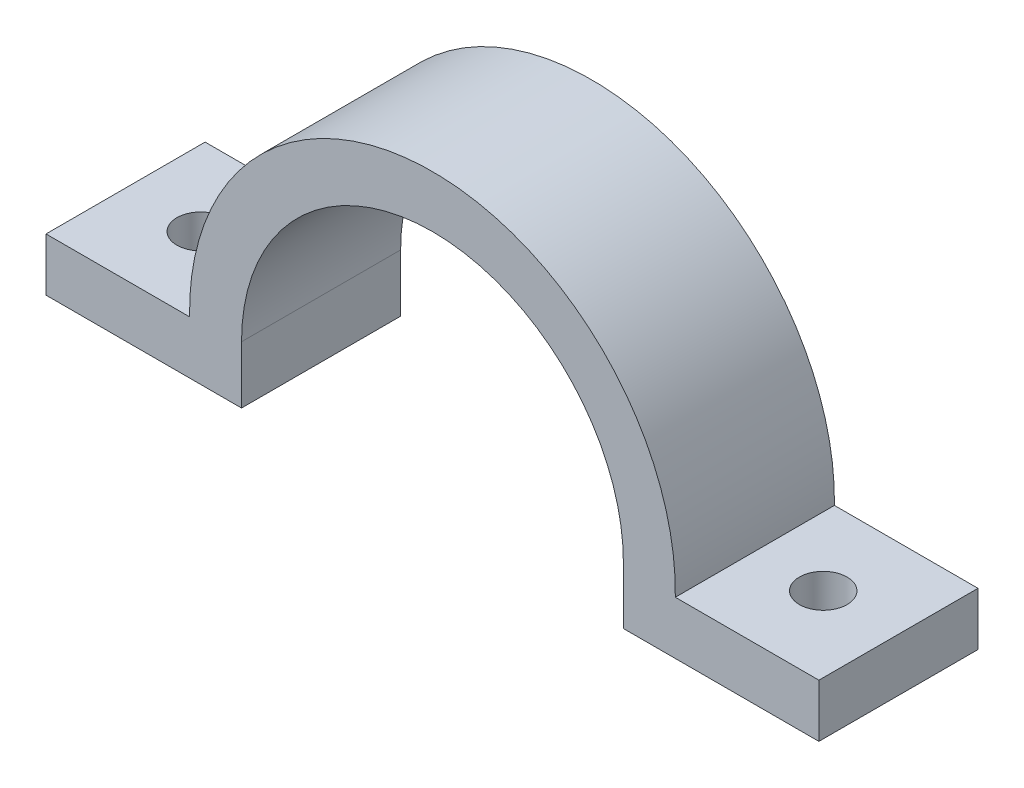
ISO-10303-21;
HEADER;
FILE_DESCRIPTION(('STEP AP214'),'2;1');
FILE_NAME('part.step','',(''),(''),'','','');
FILE_SCHEMA(('AUTOMOTIVE_DESIGN { 1 0 10303 214 1 1 1 1 }'));
ENDSEC;
DATA;
#1=APPLICATION_CONTEXT('core data for automotive mechanical design processes');
#2=APPLICATION_PROTOCOL_DEFINITION('international standard','automotive_design',2000,#1);
#3=PRODUCT_CONTEXT('',#1,'mechanical');
#4=PRODUCT('Part','Part','',(#3));
#5=PRODUCT_RELATED_PRODUCT_CATEGORY('part','',(#4));
#6=PRODUCT_DEFINITION_FORMATION('','',#4);
#7=PRODUCT_DEFINITION_CONTEXT('part definition',#1,'design');
#8=PRODUCT_DEFINITION('design','',#6,#7);
#9=PRODUCT_DEFINITION_SHAPE('','',#8);
#10=(LENGTH_UNIT() NAMED_UNIT(*) SI_UNIT(.MILLI.,.METRE.));
#11=(NAMED_UNIT(*) PLANE_ANGLE_UNIT() SI_UNIT($,.RADIAN.));
#12=(NAMED_UNIT(*) SI_UNIT($,.STERADIAN.) SOLID_ANGLE_UNIT());
#13=UNCERTAINTY_MEASURE_WITH_UNIT(LENGTH_MEASURE(1.E-05),#10,'distance_accuracy_value','');
#14=(GEOMETRIC_REPRESENTATION_CONTEXT(3) GLOBAL_UNCERTAINTY_ASSIGNED_CONTEXT((#13)) GLOBAL_UNIT_ASSIGNED_CONTEXT((#10,
#11,#12)) REPRESENTATION_CONTEXT('',''));
#15=CARTESIAN_POINT('',(0.,0.,0.));
#16=DIRECTION('',(0.,0.,1.));
#17=DIRECTION('',(1.,0.,0.));
#18=AXIS2_PLACEMENT_3D('',#15,#16,#17);
#19=CARTESIAN_POINT('',(0.,-5.4125,15.));
#20=DIRECTION('',(0.,1.,0.));
#21=DIRECTION('',(0.,0.,1.));
#22=AXIS2_PLACEMENT_3D('',#19,#20,#21);
#23=PLANE('',#22);
#24=CARTESIAN_POINT('',(-29.3423,-5.4125,7.5));
#25=DIRECTION('',(0.,1.,0.));
#26=DIRECTION('',(-1.,0.,0.));
#27=AXIS2_PLACEMENT_3D('',#24,#25,#26);
#28=CIRCLE('',#27,2.25);
#29=CARTESIAN_POINT('',(-31.5923,-5.4125,7.5));
#30=VERTEX_POINT('',#29);
#31=EDGE_CURVE('E191',#30,#30,#28,.T.);
#32=ORIENTED_EDGE('',*,*,#31,.T.);
#33=EDGE_LOOP('',(#32));
#34=FACE_BOUND('',#33,.T.);
#35=DIRECTION('',(1.,0.,0.));
#36=VECTOR('',#35,1.);
#37=CARTESIAN_POINT('',(0.,-5.4125,0.));
#38=LINE('',#37,#36);
#39=CARTESIAN_POINT('',(-36.4334,-5.4125,0.));
#40=VERTEX_POINT('',#39);
#41=CARTESIAN_POINT('',(-18.,-5.4125,0.));
#42=VERTEX_POINT('',#41);
#43=EDGE_CURVE('E152',#40,#42,#38,.T.);
#44=ORIENTED_EDGE('',*,*,#43,.T.);
#45=DIRECTION('',(0.,0.,-1.));
#46=VECTOR('',#45,1.);
#47=CARTESIAN_POINT('',(-18.,-5.4125,15.));
#48=LINE('',#47,#46);
#49=CARTESIAN_POINT('',(-18.,-5.4125,15.));
#50=VERTEX_POINT('',#49);
#51=EDGE_CURVE('E11',#50,#42,#48,.T.);
#52=ORIENTED_EDGE('',*,*,#51,.F.);
#53=DIRECTION('',(1.,0.,0.));
#54=VECTOR('',#53,1.);
#55=CARTESIAN_POINT('',(0.,-5.4125,15.));
#56=LINE('',#55,#54);
#57=CARTESIAN_POINT('',(-36.4334,-5.4125,15.));
#58=VERTEX_POINT('',#57);
#59=EDGE_CURVE('E175',#58,#50,#56,.T.);
#60=ORIENTED_EDGE('',*,*,#59,.F.);
#61=DIRECTION('',(0.,0.,-1.));
#62=VECTOR('',#61,1.);
#63=CARTESIAN_POINT('',(-36.4334,-5.4125,15.));
#64=LINE('',#63,#62);
#65=EDGE_CURVE('E59',#58,#40,#64,.T.);
#66=ORIENTED_EDGE('',*,*,#65,.T.);
#67=EDGE_LOOP('',(#44,#52,#60,#66));
#68=FACE_BOUND('',#67,.T.);
#69=ADVANCED_FACE('F41',(#34,#68),#23,.F.);
#70=CARTESIAN_POINT('',(-18.,0.,15.));
#71=DIRECTION('',(-1.,0.,0.));
#72=DIRECTION('',(0.,0.,1.));
#73=AXIS2_PLACEMENT_3D('',#70,#71,#72);
#74=PLANE('',#73);
#75=DIRECTION('',(0.,1.,0.));
#76=VECTOR('',#75,1.);
#77=CARTESIAN_POINT('',(-18.,0.,0.));
#78=LINE('',#77,#76);
#79=CARTESIAN_POINT('',(-18.,0.,0.));
#80=VERTEX_POINT('',#79);
#81=EDGE_CURVE('E154',#42,#80,#78,.T.);
#82=ORIENTED_EDGE('',*,*,#81,.T.);
#83=DIRECTION('',(0.,0.,-1.));
#84=VECTOR('',#83,1.);
#85=CARTESIAN_POINT('',(-18.,0.,15.));
#86=LINE('',#85,#84);
#87=CARTESIAN_POINT('',(-18.,0.,15.));
#88=VERTEX_POINT('',#87);
#89=EDGE_CURVE('E50',#88,#80,#86,.T.);
#90=ORIENTED_EDGE('',*,*,#89,.F.);
#91=DIRECTION('',(0.,1.,0.));
#92=VECTOR('',#91,1.);
#93=CARTESIAN_POINT('',(-18.,0.,15.));
#94=LINE('',#93,#92);
#95=EDGE_CURVE('E103',#50,#88,#94,.T.);
#96=ORIENTED_EDGE('',*,*,#95,.F.);
#97=ORIENTED_EDGE('',*,*,#51,.T.);
#98=EDGE_LOOP('',(#82,#90,#96,#97));
#99=FACE_BOUND('',#98,.T.);
#100=ADVANCED_FACE('F240',(#99),#74,.F.);
#101=CARTESIAN_POINT('',(0.,0.,15.));
#102=DIRECTION('',(0.,0.,-1.));
#103=DIRECTION('',(-1.,0.,0.));
#104=AXIS2_PLACEMENT_3D('',#101,#102,#103);
#105=CYLINDRICAL_SURFACE('',#104,18.);
#106=CARTESIAN_POINT('',(0.,0.,0.));
#107=DIRECTION('',(0.,0.,1.));
#108=DIRECTION('',(1.,0.,0.));
#109=AXIS2_PLACEMENT_3D('',#106,#107,#108);
#110=CIRCLE('',#109,18.);
#111=CARTESIAN_POINT('',(18.,0.,0.));
#112=VERTEX_POINT('',#111);
#113=EDGE_CURVE('E157',#112,#80,#110,.T.);
#114=ORIENTED_EDGE('',*,*,#113,.F.);
#115=DIRECTION('',(0.,0.,-1.));
#116=VECTOR('',#115,1.);
#117=CARTESIAN_POINT('',(18.,0.,15.));
#118=LINE('',#117,#116);
#119=CARTESIAN_POINT('',(18.,0.,15.));
#120=VERTEX_POINT('',#119);
#121=EDGE_CURVE('E187',#120,#112,#118,.T.);
#122=ORIENTED_EDGE('',*,*,#121,.F.);
#123=CARTESIAN_POINT('',(0.,0.,15.));
#124=DIRECTION('',(0.,0.,1.));
#125=DIRECTION('',(1.,0.,0.));
#126=AXIS2_PLACEMENT_3D('',#123,#124,#125);
#127=CIRCLE('',#126,18.);
#128=EDGE_CURVE('E205',#120,#88,#127,.T.);
#129=ORIENTED_EDGE('',*,*,#128,.T.);
#130=ORIENTED_EDGE('',*,*,#89,.T.);
#131=EDGE_LOOP('',(#114,#122,#129,#130));
#132=FACE_BOUND('',#131,.T.);
#133=ADVANCED_FACE('F246',(#132),#105,.F.);
#134=CARTESIAN_POINT('',(18.,0.,15.));
#135=DIRECTION('',(-1.,0.,0.));
#136=DIRECTION('',(0.,0.,1.));
#137=AXIS2_PLACEMENT_3D('',#134,#135,#136);
#138=PLANE('',#137);
#139=DIRECTION('',(0.,1.,0.));
#140=VECTOR('',#139,1.);
#141=CARTESIAN_POINT('',(18.,0.,0.));
#142=LINE('',#141,#140);
#143=CARTESIAN_POINT('',(18.,-5.4125,0.));
#144=VERTEX_POINT('',#143);
#145=EDGE_CURVE('E160',#144,#112,#142,.T.);
#146=ORIENTED_EDGE('',*,*,#145,.F.);
#147=DIRECTION('',(0.,0.,-1.));
#148=VECTOR('',#147,1.);
#149=CARTESIAN_POINT('',(18.,-5.4125,15.));
#150=LINE('',#149,#148);
#151=CARTESIAN_POINT('',(18.,-5.4125,15.));
#152=VERTEX_POINT('',#151);
#153=EDGE_CURVE('E185',#152,#144,#150,.T.);
#154=ORIENTED_EDGE('',*,*,#153,.F.);
#155=DIRECTION('',(0.,1.,0.));
#156=VECTOR('',#155,1.);
#157=CARTESIAN_POINT('',(18.,0.,15.));
#158=LINE('',#157,#156);
#159=EDGE_CURVE('E208',#152,#120,#158,.T.);
#160=ORIENTED_EDGE('',*,*,#159,.T.);
#161=ORIENTED_EDGE('',*,*,#121,.T.);
#162=EDGE_LOOP('',(#146,#154,#160,#161));
#163=FACE_BOUND('',#162,.T.);
#164=ADVANCED_FACE('F254',(#163),#138,.T.);
#165=CARTESIAN_POINT('',(0.,-5.4125,15.));
#166=DIRECTION('',(0.,1.,0.));
#167=DIRECTION('',(0.,0.,1.));
#168=AXIS2_PLACEMENT_3D('',#165,#166,#167);
#169=PLANE('',#168);
#170=CARTESIAN_POINT('',(29.3423,-5.41250000000004,7.5));
#171=DIRECTION('',(0.,1.,0.));
#172=DIRECTION('',(-1.,0.,0.));
#173=AXIS2_PLACEMENT_3D('',#170,#171,#172);
#174=CIRCLE('',#173,2.25);
#175=CARTESIAN_POINT('',(27.0923,-5.41250000000004,7.5));
#176=VERTEX_POINT('',#175);
#177=EDGE_CURVE('E196',#176,#176,#174,.T.);
#178=ORIENTED_EDGE('',*,*,#177,.T.);
#179=EDGE_LOOP('',(#178));
#180=FACE_BOUND('',#179,.T.);
#181=DIRECTION('',(1.,0.,0.));
#182=VECTOR('',#181,1.);
#183=CARTESIAN_POINT('',(0.,-5.4125,0.));
#184=LINE('',#183,#182);
#185=CARTESIAN_POINT('',(36.4334,-5.4125,0.));
#186=VERTEX_POINT('',#185);
#187=EDGE_CURVE('E163',#144,#186,#184,.T.);
#188=ORIENTED_EDGE('',*,*,#187,.T.);
#189=DIRECTION('',(0.,0.,-1.));
#190=VECTOR('',#189,1.);
#191=CARTESIAN_POINT('',(36.4334,-5.4125,15.));
#192=LINE('',#191,#190);
#193=CARTESIAN_POINT('',(36.4334,-5.4125,15.));
#194=VERTEX_POINT('',#193);
#195=EDGE_CURVE('E182',#194,#186,#192,.T.);
#196=ORIENTED_EDGE('',*,*,#195,.F.);
#197=DIRECTION('',(1.,0.,0.));
#198=VECTOR('',#197,1.);
#199=CARTESIAN_POINT('',(0.,-5.4125,15.));
#200=LINE('',#199,#198);
#201=EDGE_CURVE('E211',#152,#194,#200,.T.);
#202=ORIENTED_EDGE('',*,*,#201,.F.);
#203=ORIENTED_EDGE('',*,*,#153,.T.);
#204=EDGE_LOOP('',(#188,#196,#202,#203));
#205=FACE_BOUND('',#204,.T.);
#206=ADVANCED_FACE('F256',(#180,#205),#169,.F.);
#207=CARTESIAN_POINT('',(36.4334,0.,15.));
#208=DIRECTION('',(-1.,0.,0.));
#209=DIRECTION('',(0.,0.,1.));
#210=AXIS2_PLACEMENT_3D('',#207,#208,#209);
#211=PLANE('',#210);
#212=DIRECTION('',(0.,1.,0.));
#213=VECTOR('',#212,1.);
#214=CARTESIAN_POINT('',(36.4334,0.,0.));
#215=LINE('',#214,#213);
#216=CARTESIAN_POINT('',(36.4334,-0.412500000000001,0.));
#217=VERTEX_POINT('',#216);
#218=EDGE_CURVE('E165',#186,#217,#215,.T.);
#219=ORIENTED_EDGE('',*,*,#218,.T.);
#220=DIRECTION('',(0.,0.,-1.));
#221=VECTOR('',#220,1.);
#222=CARTESIAN_POINT('',(36.4334,-0.412500000000001,15.));
#223=LINE('',#222,#221);
#224=CARTESIAN_POINT('',(36.4334,-0.412500000000001,15.));
#225=VERTEX_POINT('',#224);
#226=EDGE_CURVE('E179',#225,#217,#223,.T.);
#227=ORIENTED_EDGE('',*,*,#226,.F.);
#228=DIRECTION('',(0.,1.,0.));
#229=VECTOR('',#228,1.);
#230=CARTESIAN_POINT('',(36.4334,0.,15.));
#231=LINE('',#230,#229);
#232=EDGE_CURVE('E213',#194,#225,#231,.T.);
#233=ORIENTED_EDGE('',*,*,#232,.F.);
#234=ORIENTED_EDGE('',*,*,#195,.T.);
#235=EDGE_LOOP('',(#219,#227,#233,#234));
#236=FACE_BOUND('',#235,.T.);
#237=ADVANCED_FACE('F220',(#236),#211,.F.);
#238=CARTESIAN_POINT('',(0.,-0.412500000000023,15.));
#239=DIRECTION('',(0.,-1.,0.));
#240=DIRECTION('',(1.,0.,0.));
#241=AXIS2_PLACEMENT_3D('',#238,#239,#240);
#242=PLANE('',#241);
#243=CARTESIAN_POINT('',(29.3423,-0.412500000000005,7.5));
#244=DIRECTION('',(0.,-1.,0.));
#245=DIRECTION('',(1.,0.,0.));
#246=AXIS2_PLACEMENT_3D('',#243,#244,#245);
#247=CIRCLE('',#246,2.25);
#248=CARTESIAN_POINT('',(31.5923,-0.412500000000004,7.5));
#249=VERTEX_POINT('',#248);
#250=EDGE_CURVE('E44',#249,#249,#247,.T.);
#251=ORIENTED_EDGE('',*,*,#250,.T.);
#252=EDGE_LOOP('',(#251));
#253=FACE_BOUND('',#252,.T.);
#254=DIRECTION('',(-1.,0.,0.));
#255=VECTOR('',#254,1.);
#256=CARTESIAN_POINT('',(0.,-0.412500000000023,0.));
#257=LINE('',#256,#255);
#258=CARTESIAN_POINT('',(22.8962844966165,-0.412500000000009,0.));
#259=VERTEX_POINT('',#258);
#260=EDGE_CURVE('E167',#217,#259,#257,.T.);
#261=ORIENTED_EDGE('',*,*,#260,.T.);
#262=DIRECTION('',(0.,0.,-1.));
#263=VECTOR('',#262,1.);
#264=CARTESIAN_POINT('',(22.8962844966165,-0.412500000000009,15.));
#265=LINE('',#264,#263);
#266=CARTESIAN_POINT('',(22.8962844966165,-0.412500000000009,15.));
#267=VERTEX_POINT('',#266);
#268=EDGE_CURVE('E144',#267,#259,#265,.T.);
#269=ORIENTED_EDGE('',*,*,#268,.F.);
#270=DIRECTION('',(-1.,0.,0.));
#271=VECTOR('',#270,1.);
#272=CARTESIAN_POINT('',(0.,-0.412500000000023,15.));
#273=LINE('',#272,#271);
#274=EDGE_CURVE('E132',#225,#267,#273,.T.);
#275=ORIENTED_EDGE('',*,*,#274,.F.);
#276=ORIENTED_EDGE('',*,*,#226,.T.);
#277=EDGE_LOOP('',(#261,#269,#275,#276));
#278=FACE_BOUND('',#277,.T.);
#279=ADVANCED_FACE('F224',(#253,#278),#242,.F.);
#280=CARTESIAN_POINT('',(0.,0.,15.));
#281=DIRECTION('',(0.,0.,-1.));
#282=DIRECTION('',(-1.,0.,0.));
#283=AXIS2_PLACEMENT_3D('',#280,#281,#282);
#284=CYLINDRICAL_SURFACE('',#283,22.9);
#285=CARTESIAN_POINT('',(0.,0.,0.));
#286=DIRECTION('',(0.,0.,1.));
#287=DIRECTION('',(1.,0.,0.));
#288=AXIS2_PLACEMENT_3D('',#285,#286,#287);
#289=CIRCLE('',#288,22.9);
#290=CARTESIAN_POINT('',(-22.8962844966165,-0.412500000000009,0.));
#291=VERTEX_POINT('',#290);
#292=EDGE_CURVE('E141',#259,#291,#289,.T.);
#293=ORIENTED_EDGE('',*,*,#292,.T.);
#294=DIRECTION('',(0.,0.,-1.));
#295=VECTOR('',#294,1.);
#296=CARTESIAN_POINT('',(-22.8962844966165,-0.412500000000009,15.));
#297=LINE('',#296,#295);
#298=CARTESIAN_POINT('',(-22.8962844966165,-0.412500000000009,15.));
#299=VERTEX_POINT('',#298);
#300=EDGE_CURVE('E138',#299,#291,#297,.T.);
#301=ORIENTED_EDGE('',*,*,#300,.F.);
#302=CARTESIAN_POINT('',(0.,0.,15.));
#303=DIRECTION('',(0.,0.,1.));
#304=DIRECTION('',(1.,0.,0.));
#305=AXIS2_PLACEMENT_3D('',#302,#303,#304);
#306=CIRCLE('',#305,22.9);
#307=EDGE_CURVE('E125',#267,#299,#306,.T.);
#308=ORIENTED_EDGE('',*,*,#307,.F.);
#309=ORIENTED_EDGE('',*,*,#268,.T.);
#310=EDGE_LOOP('',(#293,#301,#308,#309));
#311=FACE_BOUND('',#310,.T.);
#312=ADVANCED_FACE('F139',(#311),#284,.T.);
#313=CARTESIAN_POINT('',(0.,-0.412500000000023,15.));
#314=DIRECTION('',(0.,1.,0.));
#315=DIRECTION('',(-1.,0.,0.));
#316=AXIS2_PLACEMENT_3D('',#313,#314,#315);
#317=PLANE('',#316);
#318=CARTESIAN_POINT('',(-29.3423,-0.412500000000005,7.5));
#319=DIRECTION('',(0.,1.,0.));
#320=DIRECTION('',(-1.,0.,0.));
#321=AXIS2_PLACEMENT_3D('',#318,#319,#320);
#322=CIRCLE('',#321,2.25);
#323=CARTESIAN_POINT('',(-31.5923,-0.412500000000004,7.5));
#324=VERTEX_POINT('',#323);
#325=EDGE_CURVE('E189',#324,#324,#322,.T.);
#326=ORIENTED_EDGE('',*,*,#325,.F.);
#327=EDGE_LOOP('',(#326));
#328=FACE_BOUND('',#327,.T.);
#329=DIRECTION('',(1.,0.,0.));
#330=VECTOR('',#329,1.);
#331=CARTESIAN_POINT('',(0.,-0.412500000000023,0.));
#332=LINE('',#331,#330);
#333=CARTESIAN_POINT('',(-36.4334,-0.412500000000001,0.));
#334=VERTEX_POINT('',#333);
#335=EDGE_CURVE('E170',#334,#291,#332,.T.);
#336=ORIENTED_EDGE('',*,*,#335,.F.);
#337=DIRECTION('',(0.,0.,-1.));
#338=VECTOR('',#337,1.);
#339=CARTESIAN_POINT('',(-36.4334,-0.412500000000001,15.));
#340=LINE('',#339,#338);
#341=CARTESIAN_POINT('',(-36.4334,-0.412500000000001,15.));
#342=VERTEX_POINT('',#341);
#343=EDGE_CURVE('E91',#342,#334,#340,.T.);
#344=ORIENTED_EDGE('',*,*,#343,.F.);
#345=DIRECTION('',(1.,0.,0.));
#346=VECTOR('',#345,1.);
#347=CARTESIAN_POINT('',(0.,-0.412500000000023,15.));
#348=LINE('',#347,#346);
#349=EDGE_CURVE('E130',#342,#299,#348,.T.);
#350=ORIENTED_EDGE('',*,*,#349,.T.);
#351=ORIENTED_EDGE('',*,*,#300,.T.);
#352=EDGE_LOOP('',(#336,#344,#350,#351));
#353=FACE_BOUND('',#352,.T.);
#354=ADVANCED_FACE('F146',(#328,#353),#317,.T.);
#355=CARTESIAN_POINT('',(-36.4334,0.,15.));
#356=DIRECTION('',(-1.,0.,0.));
#357=DIRECTION('',(0.,0.,1.));
#358=AXIS2_PLACEMENT_3D('',#355,#356,#357);
#359=PLANE('',#358);
#360=DIRECTION('',(0.,1.,0.));
#361=VECTOR('',#360,1.);
#362=CARTESIAN_POINT('',(-36.4334,0.,0.));
#363=LINE('',#362,#361);
#364=EDGE_CURVE('E172',#40,#334,#363,.T.);
#365=ORIENTED_EDGE('',*,*,#364,.F.);
#366=ORIENTED_EDGE('',*,*,#65,.F.);
#367=DIRECTION('',(0.,1.,0.));
#368=VECTOR('',#367,1.);
#369=CARTESIAN_POINT('',(-36.4334,0.,15.));
#370=LINE('',#369,#368);
#371=EDGE_CURVE('E147',#58,#342,#370,.T.);
#372=ORIENTED_EDGE('',*,*,#371,.T.);
#373=ORIENTED_EDGE('',*,*,#343,.T.);
#374=EDGE_LOOP('',(#365,#366,#372,#373));
#375=FACE_BOUND('',#374,.T.);
#376=ADVANCED_FACE('F227',(#375),#359,.T.);
#377=CARTESIAN_POINT('',(0.,0.,15.));
#378=DIRECTION('',(0.,0.,1.));
#379=DIRECTION('',(1.,0.,0.));
#380=AXIS2_PLACEMENT_3D('',#377,#378,#379);
#381=PLANE('',#380);
#382=ORIENTED_EDGE('',*,*,#59,.T.);
#383=ORIENTED_EDGE('',*,*,#95,.T.);
#384=ORIENTED_EDGE('',*,*,#128,.F.);
#385=ORIENTED_EDGE('',*,*,#159,.F.);
#386=ORIENTED_EDGE('',*,*,#201,.T.);
#387=ORIENTED_EDGE('',*,*,#232,.T.);
#388=ORIENTED_EDGE('',*,*,#274,.T.);
#389=ORIENTED_EDGE('',*,*,#307,.T.);
#390=ORIENTED_EDGE('',*,*,#349,.F.);
#391=ORIENTED_EDGE('',*,*,#371,.F.);
#392=EDGE_LOOP('',(#382,#383,#384,#385,#386,#387,#388,#389,#390,#391));
#393=FACE_BOUND('',#392,.T.);
#394=ADVANCED_FACE('F127',(#393),#381,.T.);
#395=CARTESIAN_POINT('',(0.,0.,0.));
#396=DIRECTION('',(0.,0.,1.));
#397=DIRECTION('',(1.,0.,0.));
#398=AXIS2_PLACEMENT_3D('',#395,#396,#397);
#399=PLANE('',#398);
#400=ORIENTED_EDGE('',*,*,#43,.F.);
#401=ORIENTED_EDGE('',*,*,#364,.T.);
#402=ORIENTED_EDGE('',*,*,#335,.T.);
#403=ORIENTED_EDGE('',*,*,#292,.F.);
#404=ORIENTED_EDGE('',*,*,#260,.F.);
#405=ORIENTED_EDGE('',*,*,#218,.F.);
#406=ORIENTED_EDGE('',*,*,#187,.F.);
#407=ORIENTED_EDGE('',*,*,#145,.T.);
#408=ORIENTED_EDGE('',*,*,#113,.T.);
#409=ORIENTED_EDGE('',*,*,#81,.F.);
#410=EDGE_LOOP('',(#400,#401,#402,#403,#404,#405,#406,#407,#408,#409));
#411=FACE_BOUND('',#410,.T.);
#412=ADVANCED_FACE('F226',(#411),#399,.F.);
#413=CARTESIAN_POINT('',(-29.3423,-5.4125,7.5));
#414=DIRECTION('',(0.,1.,0.));
#415=DIRECTION('',(-1.,0.,0.));
#416=AXIS2_PLACEMENT_3D('',#413,#414,#415);
#417=CYLINDRICAL_SURFACE('',#416,2.25);
#418=ORIENTED_EDGE('',*,*,#325,.T.);
#419=EDGE_LOOP('',(#418));
#420=FACE_BOUND('',#419,.T.);
#421=ORIENTED_EDGE('',*,*,#31,.F.);
#422=EDGE_LOOP('',(#421));
#423=FACE_BOUND('',#422,.T.);
#424=ADVANCED_FACE('F325',(#420,#423),#417,.F.);
#425=CARTESIAN_POINT('',(29.3423,-5.41250000000004,7.5));
#426=DIRECTION('',(0.,1.,0.));
#427=DIRECTION('',(-1.,0.,0.));
#428=AXIS2_PLACEMENT_3D('',#425,#426,#427);
#429=CYLINDRICAL_SURFACE('',#428,2.25);
#430=ORIENTED_EDGE('',*,*,#177,.F.);
#431=EDGE_LOOP('',(#430));
#432=FACE_BOUND('',#431,.T.);
#433=ORIENTED_EDGE('',*,*,#250,.F.);
#434=EDGE_LOOP('',(#433));
#435=FACE_BOUND('',#434,.T.);
#436=ADVANCED_FACE('F338',(#432,#435),#429,.F.);
#437=CLOSED_SHELL('',(#69,#100,#133,#164,#206,#237,#279,#312,#354,#376,#394,#412,#424,#436));
#438=MANIFOLD_SOLID_BREP('B2',#437);
#439=ADVANCED_BREP_SHAPE_REPRESENTATION('',(#18,#438),#14);
#440=SHAPE_DEFINITION_REPRESENTATION(#9,#439);
ENDSEC;
END-ISO-10303-21;
